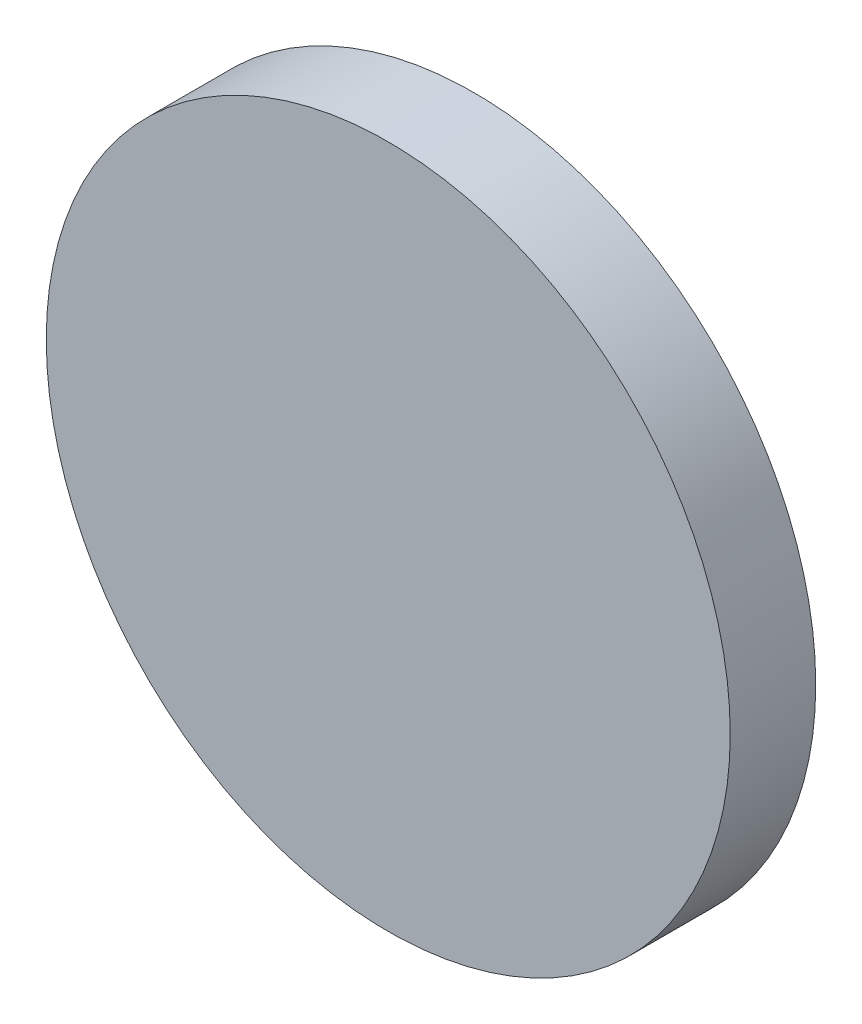
ISO-10303-21;
HEADER;
FILE_DESCRIPTION(('STEP AP214'),'2;1');
FILE_NAME('part.step','',(''),(''),'','','');
FILE_SCHEMA(('AUTOMOTIVE_DESIGN { 1 0 10303 214 1 1 1 1 }'));
ENDSEC;
DATA;
#1=APPLICATION_CONTEXT('core data for automotive mechanical design processes');
#2=APPLICATION_PROTOCOL_DEFINITION('international standard','automotive_design',2000,#1);
#3=PRODUCT_CONTEXT('',#1,'mechanical');
#4=PRODUCT('Part','Part','',(#3));
#5=PRODUCT_RELATED_PRODUCT_CATEGORY('part','',(#4));
#6=PRODUCT_DEFINITION_FORMATION('','',#4);
#7=PRODUCT_DEFINITION_CONTEXT('part definition',#1,'design');
#8=PRODUCT_DEFINITION('design','',#6,#7);
#9=PRODUCT_DEFINITION_SHAPE('','',#8);
#10=(LENGTH_UNIT() NAMED_UNIT(*) SI_UNIT(.MILLI.,.METRE.));
#11=(NAMED_UNIT(*) PLANE_ANGLE_UNIT() SI_UNIT($,.RADIAN.));
#12=(NAMED_UNIT(*) SI_UNIT($,.STERADIAN.) SOLID_ANGLE_UNIT());
#13=UNCERTAINTY_MEASURE_WITH_UNIT(LENGTH_MEASURE(1.E-05),#10,'distance_accuracy_value','');
#14=(GEOMETRIC_REPRESENTATION_CONTEXT(3) GLOBAL_UNCERTAINTY_ASSIGNED_CONTEXT((#13)) GLOBAL_UNIT_ASSIGNED_CONTEXT((#10,
#11,#12)) REPRESENTATION_CONTEXT('',''));
#15=CARTESIAN_POINT('',(0.,0.,0.));
#16=DIRECTION('',(0.,0.,1.));
#17=DIRECTION('',(1.,0.,0.));
#18=AXIS2_PLACEMENT_3D('',#15,#16,#17);
#19=CARTESIAN_POINT('',(0.,0.,0.));
#20=DIRECTION('',(0.,0.,-1.));
#21=DIRECTION('',(-1.,0.,0.));
#22=AXIS2_PLACEMENT_3D('',#19,#20,#21);
#23=PLANE('',#22);
#24=CARTESIAN_POINT('',(0.,0.,0.));
#25=DIRECTION('',(0.,0.,1.));
#26=DIRECTION('',(1.,0.,0.));
#27=AXIS2_PLACEMENT_3D('',#24,#25,#26);
#28=CIRCLE('',#27,20.);
#29=CARTESIAN_POINT('',(20.,0.,0.));
#30=VERTEX_POINT('',#29);
#31=EDGE_CURVE('E17',#30,#30,#28,.T.);
#32=ORIENTED_EDGE('',*,*,#31,.F.);
#33=EDGE_LOOP('',(#32));
#34=FACE_BOUND('',#33,.T.);
#35=ADVANCED_FACE('F14',(#34),#23,.T.);
#36=CARTESIAN_POINT('',(0.,0.,0.));
#37=DIRECTION('',(0.,0.,1.));
#38=DIRECTION('',(1.,0.,0.));
#39=AXIS2_PLACEMENT_3D('',#36,#37,#38);
#40=CYLINDRICAL_SURFACE('',#39,20.);
#41=ORIENTED_EDGE('',*,*,#31,.T.);
#42=EDGE_LOOP('',(#41));
#43=FACE_BOUND('',#42,.T.);
#44=CARTESIAN_POINT('',(0.,0.,5.));
#45=DIRECTION('',(0.,0.,1.));
#46=DIRECTION('',(1.,0.,0.));
#47=AXIS2_PLACEMENT_3D('',#44,#45,#46);
#48=CIRCLE('',#47,20.);
#49=CARTESIAN_POINT('',(20.,0.,5.));
#50=VERTEX_POINT('',#49);
#51=EDGE_CURVE('E10',#50,#50,#48,.F.);
#52=ORIENTED_EDGE('',*,*,#51,.T.);
#53=EDGE_LOOP('',(#52));
#54=FACE_BOUND('',#53,.T.);
#55=ADVANCED_FACE('F26',(#43,#54),#40,.T.);
#56=CARTESIAN_POINT('',(0.,0.,5.));
#57=DIRECTION('',(0.,0.,-1.));
#58=DIRECTION('',(-1.,0.,0.));
#59=AXIS2_PLACEMENT_3D('',#56,#57,#58);
#60=PLANE('',#59);
#61=ORIENTED_EDGE('',*,*,#51,.F.);
#62=EDGE_LOOP('',(#61));
#63=FACE_BOUND('',#62,.T.);
#64=ADVANCED_FACE('F33',(#63),#60,.F.);
#65=CLOSED_SHELL('',(#35,#55,#64));
#66=MANIFOLD_SOLID_BREP('B1',#65);
#67=ADVANCED_BREP_SHAPE_REPRESENTATION('',(#18,#66),#14);
#68=SHAPE_DEFINITION_REPRESENTATION(#9,#67);
ENDSEC;
END-ISO-10303-21;
